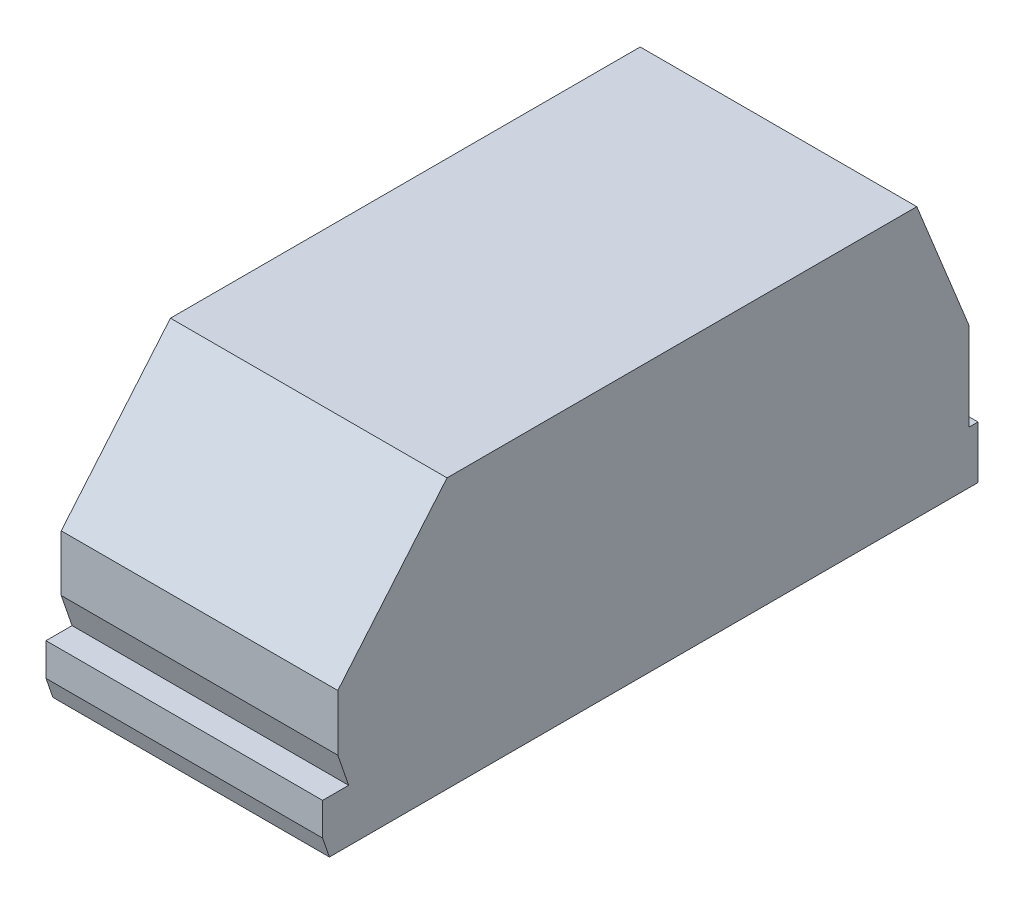
ISO-10303-21;
HEADER;
FILE_DESCRIPTION(('STEP AP214'),'2;1');
FILE_NAME('part.step','',(''),(''),'','','');
FILE_SCHEMA(('AUTOMOTIVE_DESIGN { 1 0 10303 214 1 1 1 1 }'));
ENDSEC;
DATA;
#1=APPLICATION_CONTEXT('core data for automotive mechanical design processes');
#2=APPLICATION_PROTOCOL_DEFINITION('international standard','automotive_design',2000,#1);
#3=PRODUCT_CONTEXT('',#1,'mechanical');
#4=PRODUCT('Part','Part','',(#3));
#5=PRODUCT_RELATED_PRODUCT_CATEGORY('part','',(#4));
#6=PRODUCT_DEFINITION_FORMATION('','',#4);
#7=PRODUCT_DEFINITION_CONTEXT('part definition',#1,'design');
#8=PRODUCT_DEFINITION('design','',#6,#7);
#9=PRODUCT_DEFINITION_SHAPE('','',#8);
#10=(LENGTH_UNIT() NAMED_UNIT(*) SI_UNIT(.MILLI.,.METRE.));
#11=(NAMED_UNIT(*) PLANE_ANGLE_UNIT() SI_UNIT($,.RADIAN.));
#12=(NAMED_UNIT(*) SI_UNIT($,.STERADIAN.) SOLID_ANGLE_UNIT());
#13=UNCERTAINTY_MEASURE_WITH_UNIT(LENGTH_MEASURE(1.E-05),#10,'distance_accuracy_value','');
#14=(GEOMETRIC_REPRESENTATION_CONTEXT(3) GLOBAL_UNCERTAINTY_ASSIGNED_CONTEXT((#13)) GLOBAL_UNIT_ASSIGNED_CONTEXT((#10,
#11,#12)) REPRESENTATION_CONTEXT('',''));
#15=CARTESIAN_POINT('',(0.,0.,0.));
#16=DIRECTION('',(0.,0.,1.));
#17=DIRECTION('',(1.,0.,0.));
#18=AXIS2_PLACEMENT_3D('',#15,#16,#17);
#19=CARTESIAN_POINT('',(39.5,-14.325502792435,93.189341728385));
#20=DIRECTION('',(0.,-1.,0.));
#21=DIRECTION('',(0.,0.,-1.));
#22=AXIS2_PLACEMENT_3D('',#19,#20,#21);
#23=PLANE('',#22);
#24=DIRECTION('',(0.,0.,1.));
#25=VECTOR('',#24,1.);
#26=CARTESIAN_POINT('',(-39.5,-14.325502792435,93.189341728385));
#27=LINE('',#26,#25);
#28=CARTESIAN_POINT('',(-39.5,-14.325502792435,85.7427536477865));
#29=VERTEX_POINT('',#28);
#30=CARTESIAN_POINT('',(-39.5,-14.325502792435,93.189341728385));
#31=VERTEX_POINT('',#30);
#32=EDGE_CURVE('E164',#29,#31,#27,.T.);
#33=ORIENTED_EDGE('',*,*,#32,.T.);
#34=DIRECTION('',(-1.,0.,0.));
#35=VECTOR('',#34,1.);
#36=CARTESIAN_POINT('',(39.5,-14.325502792435,93.189341728385));
#37=LINE('',#36,#35);
#38=CARTESIAN_POINT('',(39.5,-14.325502792435,93.189341728385));
#39=VERTEX_POINT('',#38);
#40=EDGE_CURVE('E11',#39,#31,#37,.T.);
#41=ORIENTED_EDGE('',*,*,#40,.F.);
#42=DIRECTION('',(0.,0.,1.));
#43=VECTOR('',#42,1.);
#44=CARTESIAN_POINT('',(39.5,-14.325502792435,93.189341728385));
#45=LINE('',#44,#43);
#46=CARTESIAN_POINT('',(39.5,-14.325502792435,85.7427536477865));
#47=VERTEX_POINT('',#46);
#48=EDGE_CURVE('E200',#47,#39,#45,.T.);
#49=ORIENTED_EDGE('',*,*,#48,.F.);
#50=DIRECTION('',(-1.,0.,0.));
#51=VECTOR('',#50,1.);
#52=CARTESIAN_POINT('',(39.5,-14.325502792435,85.7427536477865));
#53=LINE('',#52,#51);
#54=EDGE_CURVE('E160',#47,#29,#53,.T.);
#55=ORIENTED_EDGE('',*,*,#54,.T.);
#56=EDGE_LOOP('',(#33,#41,#49,#55));
#57=FACE_BOUND('',#56,.T.);
#58=ADVANCED_FACE('F39',(#57),#23,.F.);
#59=CARTESIAN_POINT('',(39.5,-23.6523913388391,93.189341728385));
#60=DIRECTION('',(0.,0.,-1.));
#61=DIRECTION('',(-1.,0.,0.));
#62=AXIS2_PLACEMENT_3D('',#59,#60,#61);
#63=PLANE('',#62);
#64=DIRECTION('',(0.,-1.,0.));
#65=VECTOR('',#64,1.);
#66=CARTESIAN_POINT('',(-39.5,-23.6523913388391,93.189341728385));
#67=LINE('',#66,#65);
#68=CARTESIAN_POINT('',(-39.5,-23.6523913388391,93.189341728385));
#69=VERTEX_POINT('',#68);
#70=EDGE_CURVE('E168',#31,#69,#67,.T.);
#71=ORIENTED_EDGE('',*,*,#70,.T.);
#72=DIRECTION('',(-1.,0.,0.));
#73=VECTOR('',#72,1.);
#74=CARTESIAN_POINT('',(39.5,-23.6523913388391,93.189341728385));
#75=LINE('',#74,#73);
#76=CARTESIAN_POINT('',(39.5,-23.6523913388391,93.189341728385));
#77=VERTEX_POINT('',#76);
#78=EDGE_CURVE('E48',#77,#69,#75,.T.);
#79=ORIENTED_EDGE('',*,*,#78,.F.);
#80=DIRECTION('',(0.,-1.,0.));
#81=VECTOR('',#80,1.);
#82=CARTESIAN_POINT('',(39.5,-23.6523913388391,93.189341728385));
#83=LINE('',#82,#81);
#84=EDGE_CURVE('E111',#39,#77,#83,.T.);
#85=ORIENTED_EDGE('',*,*,#84,.F.);
#86=ORIENTED_EDGE('',*,*,#40,.T.);
#87=EDGE_LOOP('',(#71,#79,#85,#86));
#88=FACE_BOUND('',#87,.T.);
#89=ADVANCED_FACE('F292',(#88),#63,.F.);
#90=CARTESIAN_POINT('',(39.5,-29.325502792435,91.2359328016421));
#91=DIRECTION('',(0.,0.325568154457156,-0.945518575599317));
#92=DIRECTION('',(0.,0.945518575599317,0.325568154457156));
#93=AXIS2_PLACEMENT_3D('',#90,#91,#92);
#94=PLANE('',#93);
#95=DIRECTION('',(0.,-0.945518575599317,-0.325568154457156));
#96=VECTOR('',#95,1.);
#97=CARTESIAN_POINT('',(-39.5,-29.325502792435,91.2359328016421));
#98=LINE('',#97,#96);
#99=CARTESIAN_POINT('',(-39.5,-29.325502792435,91.2359328016421));
#100=VERTEX_POINT('',#99);
#101=EDGE_CURVE('E171',#69,#100,#98,.T.);
#102=ORIENTED_EDGE('',*,*,#101,.T.);
#103=DIRECTION('',(-1.,0.,0.));
#104=VECTOR('',#103,1.);
#105=CARTESIAN_POINT('',(39.5,-29.325502792435,91.2359328016421));
#106=LINE('',#105,#104);
#107=CARTESIAN_POINT('',(39.5,-29.325502792435,91.2359328016421));
#108=VERTEX_POINT('',#107);
#109=EDGE_CURVE('E227',#108,#100,#106,.T.);
#110=ORIENTED_EDGE('',*,*,#109,.F.);
#111=DIRECTION('',(0.,-0.945518575599317,-0.325568154457156));
#112=VECTOR('',#111,1.);
#113=CARTESIAN_POINT('',(39.5,-29.325502792435,91.2359328016421));
#114=LINE('',#113,#112);
#115=EDGE_CURVE('E237',#77,#108,#114,.T.);
#116=ORIENTED_EDGE('',*,*,#115,.F.);
#117=ORIENTED_EDGE('',*,*,#78,.T.);
#118=EDGE_LOOP('',(#102,#110,#116,#117));
#119=FACE_BOUND('',#118,.T.);
#120=ADVANCED_FACE('F235',(#119),#94,.F.);
#121=CARTESIAN_POINT('',(39.5,-29.3255027924351,-94.010658271615));
#122=DIRECTION('',(0.,1.,0.));
#123=DIRECTION('',(0.,0.,1.));
#124=AXIS2_PLACEMENT_3D('',#121,#122,#123);
#125=PLANE('',#124);
#126=DIRECTION('',(0.,0.,-1.));
#127=VECTOR('',#126,1.);
#128=CARTESIAN_POINT('',(-39.5,-29.3255027924351,-94.010658271615));
#129=LINE('',#128,#127);
#130=CARTESIAN_POINT('',(-39.5,-29.3255027924351,-94.010658271615));
#131=VERTEX_POINT('',#130);
#132=EDGE_CURVE('E175',#100,#131,#129,.T.);
#133=ORIENTED_EDGE('',*,*,#132,.T.);
#134=DIRECTION('',(-1.,0.,0.));
#135=VECTOR('',#134,1.);
#136=CARTESIAN_POINT('',(39.5,-29.3255027924351,-94.010658271615));
#137=LINE('',#136,#135);
#138=CARTESIAN_POINT('',(39.5,-29.3255027924351,-94.010658271615));
#139=VERTEX_POINT('',#138);
#140=EDGE_CURVE('E223',#139,#131,#137,.T.);
#141=ORIENTED_EDGE('',*,*,#140,.F.);
#142=DIRECTION('',(0.,0.,-1.));
#143=VECTOR('',#142,1.);
#144=CARTESIAN_POINT('',(39.5,-29.325502792435,80.4455199202823));
#145=LINE('',#144,#143);
#146=EDGE_CURVE('E255',#108,#139,#145,.T.);
#147=ORIENTED_EDGE('',*,*,#146,.F.);
#148=ORIENTED_EDGE('',*,*,#109,.T.);
#149=EDGE_LOOP('',(#133,#141,#147,#148));
#150=FACE_BOUND('',#149,.T.);
#151=ADVANCED_FACE('F245',(#150),#125,.F.);
#152=CARTESIAN_POINT('',(39.5,-14.3255027924351,-94.010658271615));
#153=DIRECTION('',(0.,0.,1.));
#154=DIRECTION('',(0.,-1.,0.));
#155=AXIS2_PLACEMENT_3D('',#152,#153,#154);
#156=PLANE('',#155);
#157=DIRECTION('',(0.,1.,0.));
#158=VECTOR('',#157,1.);
#159=CARTESIAN_POINT('',(-39.5,-14.3255027924351,-94.010658271615));
#160=LINE('',#159,#158);
#161=CARTESIAN_POINT('',(-39.5,-14.3255027924351,-94.010658271615));
#162=VERTEX_POINT('',#161);
#163=EDGE_CURVE('E178',#131,#162,#160,.T.);
#164=ORIENTED_EDGE('',*,*,#163,.T.);
#165=DIRECTION('',(-1.,0.,0.));
#166=VECTOR('',#165,1.);
#167=CARTESIAN_POINT('',(39.5,-14.3255027924351,-94.010658271615));
#168=LINE('',#167,#166);
#169=CARTESIAN_POINT('',(39.5,-14.3255027924351,-94.010658271615));
#170=VERTEX_POINT('',#169);
#171=EDGE_CURVE('E219',#170,#162,#168,.T.);
#172=ORIENTED_EDGE('',*,*,#171,.F.);
#173=DIRECTION('',(0.,1.,0.));
#174=VECTOR('',#173,1.);
#175=CARTESIAN_POINT('',(39.5,-14.3255027924351,-94.010658271615));
#176=LINE('',#175,#174);
#177=EDGE_CURVE('E251',#139,#170,#176,.T.);
#178=ORIENTED_EDGE('',*,*,#177,.F.);
#179=ORIENTED_EDGE('',*,*,#140,.T.);
#180=EDGE_LOOP('',(#164,#172,#178,#179));
#181=FACE_BOUND('',#180,.T.);
#182=ADVANCED_FACE('F249',(#181),#156,.F.);
#183=CARTESIAN_POINT('',(39.5,-14.3255027924351,-91.510658271615));
#184=DIRECTION('',(0.,-1.,0.));
#185=DIRECTION('',(0.,0.,-1.));
#186=AXIS2_PLACEMENT_3D('',#183,#184,#185);
#187=PLANE('',#186);
#188=DIRECTION('',(0.,0.,1.));
#189=VECTOR('',#188,1.);
#190=CARTESIAN_POINT('',(-39.5,-14.3255027924351,-91.510658271615));
#191=LINE('',#190,#189);
#192=CARTESIAN_POINT('',(-39.5,-14.3255027924351,-91.510658271615));
#193=VERTEX_POINT('',#192);
#194=EDGE_CURVE('E181',#162,#193,#191,.T.);
#195=ORIENTED_EDGE('',*,*,#194,.T.);
#196=DIRECTION('',(-1.,0.,0.));
#197=VECTOR('',#196,1.);
#198=CARTESIAN_POINT('',(39.5,-14.3255027924351,-91.510658271615));
#199=LINE('',#198,#197);
#200=CARTESIAN_POINT('',(39.5,-14.3255027924351,-91.510658271615));
#201=VERTEX_POINT('',#200);
#202=EDGE_CURVE('E215',#201,#193,#199,.T.);
#203=ORIENTED_EDGE('',*,*,#202,.F.);
#204=DIRECTION('',(0.,0.,1.));
#205=VECTOR('',#204,1.);
#206=CARTESIAN_POINT('',(39.5,-14.3255027924351,-91.510658271615));
#207=LINE('',#206,#205);
#208=EDGE_CURVE('E254',#170,#201,#207,.T.);
#209=ORIENTED_EDGE('',*,*,#208,.F.);
#210=ORIENTED_EDGE('',*,*,#171,.T.);
#211=EDGE_LOOP('',(#195,#203,#209,#210));
#212=FACE_BOUND('',#211,.T.);
#213=ADVANCED_FACE('F305',(#212),#187,.F.);
#214=CARTESIAN_POINT('',(39.5,10.6744972075649,-91.510658271615));
#215=DIRECTION('',(0.,0.,1.));
#216=DIRECTION('',(0.,-1.,0.));
#217=AXIS2_PLACEMENT_3D('',#214,#215,#216);
#218=PLANE('',#217);
#219=DIRECTION('',(0.,1.,0.));
#220=VECTOR('',#219,1.);
#221=CARTESIAN_POINT('',(-39.5,10.6744972075649,-91.510658271615));
#222=LINE('',#221,#220);
#223=CARTESIAN_POINT('',(-39.5,10.6744972075649,-91.510658271615));
#224=VERTEX_POINT('',#223);
#225=EDGE_CURVE('E184',#193,#224,#222,.T.);
#226=ORIENTED_EDGE('',*,*,#225,.T.);
#227=DIRECTION('',(-1.,0.,0.));
#228=VECTOR('',#227,1.);
#229=CARTESIAN_POINT('',(39.5,10.6744972075649,-91.510658271615));
#230=LINE('',#229,#228);
#231=CARTESIAN_POINT('',(39.5,10.6744972075649,-91.510658271615));
#232=VERTEX_POINT('',#231);
#233=EDGE_CURVE('E211',#232,#224,#230,.T.);
#234=ORIENTED_EDGE('',*,*,#233,.F.);
#235=DIRECTION('',(0.,1.,0.));
#236=VECTOR('',#235,1.);
#237=CARTESIAN_POINT('',(39.5,10.6744972075649,-91.510658271615));
#238=LINE('',#237,#236);
#239=EDGE_CURVE('E259',#201,#232,#238,.T.);
#240=ORIENTED_EDGE('',*,*,#239,.F.);
#241=ORIENTED_EDGE('',*,*,#202,.T.);
#242=EDGE_LOOP('',(#226,#234,#240,#241));
#243=FACE_BOUND('',#242,.T.);
#244=ADVANCED_FACE('F308',(#243),#218,.F.);
#245=CARTESIAN_POINT('',(39.5,47.674497207565,-76.5266266389635));
#246=DIRECTION('',(0.,-0.375361527567572,0.926878483741067));
#247=DIRECTION('',(0.,-0.926878483741067,-0.375361527567572));
#248=AXIS2_PLACEMENT_3D('',#245,#246,#247);
#249=PLANE('',#248);
#250=DIRECTION('',(0.,0.926878483741067,0.375361527567572));
#251=VECTOR('',#250,1.);
#252=CARTESIAN_POINT('',(-39.5,47.674497207565,-76.5266266389635));
#253=LINE('',#252,#251);
#254=CARTESIAN_POINT('',(-39.5,47.674497207565,-76.5266266389635));
#255=VERTEX_POINT('',#254);
#256=EDGE_CURVE('E188',#224,#255,#253,.T.);
#257=ORIENTED_EDGE('',*,*,#256,.T.);
#258=DIRECTION('',(-1.,0.,0.));
#259=VECTOR('',#258,1.);
#260=CARTESIAN_POINT('',(39.5,47.674497207565,-76.5266266389635));
#261=LINE('',#260,#259);
#262=CARTESIAN_POINT('',(39.5,47.674497207565,-76.5266266389635));
#263=VERTEX_POINT('',#262);
#264=EDGE_CURVE('E207',#263,#255,#261,.T.);
#265=ORIENTED_EDGE('',*,*,#264,.F.);
#266=DIRECTION('',(0.,0.926878483741066,0.375361527567574));
#267=VECTOR('',#266,1.);
#268=CARTESIAN_POINT('',(39.5,18.292332187703,-88.4256344793256));
#269=LINE('',#268,#267);
#270=EDGE_CURVE('E266',#232,#263,#269,.T.);
#271=ORIENTED_EDGE('',*,*,#270,.F.);
#272=ORIENTED_EDGE('',*,*,#233,.T.);
#273=EDGE_LOOP('',(#257,#265,#271,#272));
#274=FACE_BOUND('',#273,.T.);
#275=ADVANCED_FACE('F274',(#274),#249,.F.);
#276=CARTESIAN_POINT('',(39.5,47.674497207565,57.6494724823621));
#277=DIRECTION('',(0.,-1.,0.));
#278=DIRECTION('',(0.,0.,-1.));
#279=AXIS2_PLACEMENT_3D('',#276,#277,#278);
#280=PLANE('',#279);
#281=DIRECTION('',(0.,0.,1.));
#282=VECTOR('',#281,1.);
#283=CARTESIAN_POINT('',(-39.5,47.674497207565,57.6494724823621));
#284=LINE('',#283,#282);
#285=CARTESIAN_POINT('',(-39.5,47.674497207565,57.6494724823621));
#286=VERTEX_POINT('',#285);
#287=EDGE_CURVE('E191',#255,#286,#284,.T.);
#288=ORIENTED_EDGE('',*,*,#287,.T.);
#289=DIRECTION('',(-1.,0.,0.));
#290=VECTOR('',#289,1.);
#291=CARTESIAN_POINT('',(39.5,47.674497207565,57.6494724823621));
#292=LINE('',#291,#290);
#293=CARTESIAN_POINT('',(39.5,47.674497207565,57.6494724823621));
#294=VERTEX_POINT('',#293);
#295=EDGE_CURVE('E153',#294,#286,#292,.T.);
#296=ORIENTED_EDGE('',*,*,#295,.F.);
#297=DIRECTION('',(0.,0.,1.));
#298=VECTOR('',#297,1.);
#299=CARTESIAN_POINT('',(39.5,47.674497207565,57.6494724823621));
#300=LINE('',#299,#298);
#301=EDGE_CURVE('E142',#263,#294,#300,.T.);
#302=ORIENTED_EDGE('',*,*,#301,.F.);
#303=ORIENTED_EDGE('',*,*,#264,.T.);
#304=EDGE_LOOP('',(#288,#296,#302,#303));
#305=FACE_BOUND('',#304,.T.);
#306=ADVANCED_FACE('F277',(#305),#280,.F.);
#307=CARTESIAN_POINT('',(39.5,10.674497207565,88.8417021673935));
#308=DIRECTION('',(0.,-0.644550766612077,-0.76456151437264));
#309=DIRECTION('',(0.,0.76456151437264,-0.644550766612077));
#310=AXIS2_PLACEMENT_3D('',#307,#308,#309);
#311=PLANE('',#310);
#312=DIRECTION('',(0.,-0.76456151437264,0.644550766612077));
#313=VECTOR('',#312,1.);
#314=CARTESIAN_POINT('',(-39.5,10.674497207565,88.8417021673935));
#315=LINE('',#314,#313);
#316=CARTESIAN_POINT('',(-39.5,10.674497207565,88.8417021673935));
#317=VERTEX_POINT('',#316);
#318=EDGE_CURVE('E151',#286,#317,#315,.T.);
#319=ORIENTED_EDGE('',*,*,#318,.T.);
#320=DIRECTION('',(-1.,0.,0.));
#321=VECTOR('',#320,1.);
#322=CARTESIAN_POINT('',(39.5,10.674497207565,88.8417021673935));
#323=LINE('',#322,#321);
#324=CARTESIAN_POINT('',(39.5,10.674497207565,88.8417021673935));
#325=VERTEX_POINT('',#324);
#326=EDGE_CURVE('E148',#325,#317,#323,.T.);
#327=ORIENTED_EDGE('',*,*,#326,.F.);
#328=DIRECTION('',(0.,-0.76456151437264,0.644550766612077));
#329=VECTOR('',#328,1.);
#330=CARTESIAN_POINT('',(39.5,10.674497207565,88.8417021673935));
#331=LINE('',#330,#329);
#332=EDGE_CURVE('E136',#294,#325,#331,.T.);
#333=ORIENTED_EDGE('',*,*,#332,.F.);
#334=ORIENTED_EDGE('',*,*,#295,.T.);
#335=EDGE_LOOP('',(#319,#327,#333,#334));
#336=FACE_BOUND('',#335,.T.);
#337=ADVANCED_FACE('F149',(#336),#311,.F.);
#338=CARTESIAN_POINT('',(39.5,-5.32550279243498,88.8417021673935));
#339=DIRECTION('',(0.,0.,-1.));
#340=DIRECTION('',(0.,1.,0.));
#341=AXIS2_PLACEMENT_3D('',#338,#339,#340);
#342=PLANE('',#341);
#343=DIRECTION('',(0.,-1.,0.));
#344=VECTOR('',#343,1.);
#345=CARTESIAN_POINT('',(-39.5,-5.32550279243498,88.8417021673935));
#346=LINE('',#345,#344);
#347=CARTESIAN_POINT('',(-39.5,-5.32550279243498,88.8417021673935));
#348=VERTEX_POINT('',#347);
#349=EDGE_CURVE('E97',#317,#348,#346,.T.);
#350=ORIENTED_EDGE('',*,*,#349,.T.);
#351=DIRECTION('',(-1.,0.,0.));
#352=VECTOR('',#351,1.);
#353=CARTESIAN_POINT('',(39.5,-5.32550279243498,88.8417021673935));
#354=LINE('',#353,#352);
#355=CARTESIAN_POINT('',(39.5,-5.32550279243498,88.8417021673935));
#356=VERTEX_POINT('',#355);
#357=EDGE_CURVE('E154',#356,#348,#354,.T.);
#358=ORIENTED_EDGE('',*,*,#357,.F.);
#359=DIRECTION('',(0.,-1.,0.));
#360=VECTOR('',#359,1.);
#361=CARTESIAN_POINT('',(39.5,-5.32550279243498,88.8417021673935));
#362=LINE('',#361,#360);
#363=EDGE_CURVE('E140',#325,#356,#362,.T.);
#364=ORIENTED_EDGE('',*,*,#363,.F.);
#365=ORIENTED_EDGE('',*,*,#326,.T.);
#366=EDGE_LOOP('',(#350,#358,#364,#365));
#367=FACE_BOUND('',#366,.T.);
#368=ADVANCED_FACE('F156',(#367),#342,.F.);
#369=CARTESIAN_POINT('',(39.5,-14.325502792435,85.7427536477865));
#370=DIRECTION('',(0.,0.325568154457159,-0.945518575599316));
#371=DIRECTION('',(0.,0.945518575599316,0.325568154457159));
#372=AXIS2_PLACEMENT_3D('',#369,#370,#371);
#373=PLANE('',#372);
#374=DIRECTION('',(0.,-0.945518575599316,-0.325568154457159));
#375=VECTOR('',#374,1.);
#376=CARTESIAN_POINT('',(-39.5,-14.325502792435,85.7427536477865));
#377=LINE('',#376,#375);
#378=EDGE_CURVE('E103',#348,#29,#377,.T.);
#379=ORIENTED_EDGE('',*,*,#378,.T.);
#380=ORIENTED_EDGE('',*,*,#54,.F.);
#381=DIRECTION('',(0.,-0.945518575599316,-0.325568154457159));
#382=VECTOR('',#381,1.);
#383=CARTESIAN_POINT('',(39.5,-14.325502792435,85.7427536477865));
#384=LINE('',#383,#382);
#385=EDGE_CURVE('E56',#356,#47,#384,.T.);
#386=ORIENTED_EDGE('',*,*,#385,.F.);
#387=ORIENTED_EDGE('',*,*,#357,.T.);
#388=EDGE_LOOP('',(#379,#380,#386,#387));
#389=FACE_BOUND('',#388,.T.);
#390=ADVANCED_FACE('F281',(#389),#373,.F.);
#391=CARTESIAN_POINT('',(39.5,0.,0.));
#392=DIRECTION('',(1.,0.,0.));
#393=DIRECTION('',(0.,0.,-1.));
#394=AXIS2_PLACEMENT_3D('',#391,#392,#393);
#395=PLANE('',#394);
#396=ORIENTED_EDGE('',*,*,#48,.T.);
#397=ORIENTED_EDGE('',*,*,#84,.T.);
#398=ORIENTED_EDGE('',*,*,#115,.T.);
#399=ORIENTED_EDGE('',*,*,#146,.T.);
#400=ORIENTED_EDGE('',*,*,#177,.T.);
#401=ORIENTED_EDGE('',*,*,#208,.T.);
#402=ORIENTED_EDGE('',*,*,#239,.T.);
#403=ORIENTED_EDGE('',*,*,#270,.T.);
#404=ORIENTED_EDGE('',*,*,#301,.T.);
#405=ORIENTED_EDGE('',*,*,#332,.T.);
#406=ORIENTED_EDGE('',*,*,#363,.T.);
#407=ORIENTED_EDGE('',*,*,#385,.T.);
#408=EDGE_LOOP('',(#396,#397,#398,#399,#400,#401,#402,#403,#404,#405,#406,#407));
#409=FACE_BOUND('',#408,.T.);
#410=ADVANCED_FACE('F138',(#409),#395,.T.);
#411=CARTESIAN_POINT('',(-39.5,0.,0.));
#412=DIRECTION('',(1.,0.,0.));
#413=DIRECTION('',(0.,0.,-1.));
#414=AXIS2_PLACEMENT_3D('',#411,#412,#413);
#415=PLANE('',#414);
#416=ORIENTED_EDGE('',*,*,#32,.F.);
#417=ORIENTED_EDGE('',*,*,#378,.F.);
#418=ORIENTED_EDGE('',*,*,#349,.F.);
#419=ORIENTED_EDGE('',*,*,#318,.F.);
#420=ORIENTED_EDGE('',*,*,#287,.F.);
#421=ORIENTED_EDGE('',*,*,#256,.F.);
#422=ORIENTED_EDGE('',*,*,#225,.F.);
#423=ORIENTED_EDGE('',*,*,#194,.F.);
#424=ORIENTED_EDGE('',*,*,#163,.F.);
#425=ORIENTED_EDGE('',*,*,#132,.F.);
#426=ORIENTED_EDGE('',*,*,#101,.F.);
#427=ORIENTED_EDGE('',*,*,#70,.F.);
#428=EDGE_LOOP('',(#416,#417,#418,#419,#420,#421,#422,#423,#424,#425,#426,#427));
#429=FACE_BOUND('',#428,.T.);
#430=ADVANCED_FACE('F240',(#429),#415,.F.);
#431=CLOSED_SHELL('',(#58,#89,#120,#151,#182,#213,#244,#275,#306,#337,#368,#390,#410,#430));
#432=MANIFOLD_SOLID_BREP('B2',#431);
#433=ADVANCED_BREP_SHAPE_REPRESENTATION('',(#18,#432),#14);
#434=SHAPE_DEFINITION_REPRESENTATION(#9,#433);
ENDSEC;
END-ISO-10303-21;
